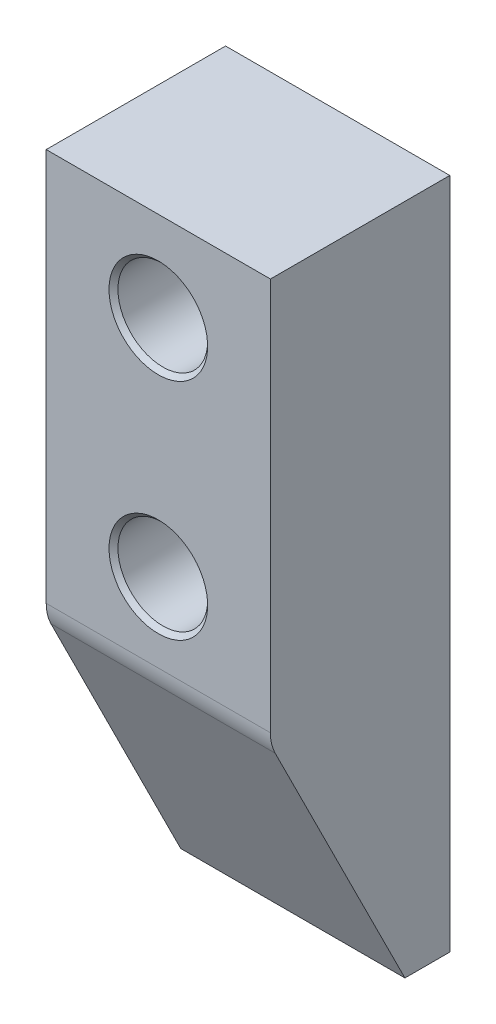
ISO-10303-21;
HEADER;
FILE_DESCRIPTION(('STEP AP214'),'2;1');
FILE_NAME('part.step','',(''),(''),'','','');
FILE_SCHEMA(('AUTOMOTIVE_DESIGN { 1 0 10303 214 1 1 1 1 }'));
ENDSEC;
DATA;
#1=APPLICATION_CONTEXT('core data for automotive mechanical design processes');
#2=APPLICATION_PROTOCOL_DEFINITION('international standard','automotive_design',2000,#1);
#3=PRODUCT_CONTEXT('',#1,'mechanical');
#4=PRODUCT('Part','Part','',(#3));
#5=PRODUCT_RELATED_PRODUCT_CATEGORY('part','',(#4));
#6=PRODUCT_DEFINITION_FORMATION('','',#4);
#7=PRODUCT_DEFINITION_CONTEXT('part definition',#1,'design');
#8=PRODUCT_DEFINITION('design','',#6,#7);
#9=PRODUCT_DEFINITION_SHAPE('','',#8);
#10=(LENGTH_UNIT() NAMED_UNIT(*) SI_UNIT(.MILLI.,.METRE.));
#11=(NAMED_UNIT(*) PLANE_ANGLE_UNIT() SI_UNIT($,.RADIAN.));
#12=(NAMED_UNIT(*) SI_UNIT($,.STERADIAN.) SOLID_ANGLE_UNIT());
#13=UNCERTAINTY_MEASURE_WITH_UNIT(LENGTH_MEASURE(1.E-05),#10,'distance_accuracy_value','');
#14=(GEOMETRIC_REPRESENTATION_CONTEXT(3) GLOBAL_UNCERTAINTY_ASSIGNED_CONTEXT((#13)) GLOBAL_UNIT_ASSIGNED_CONTEXT((#10,
#11,#12)) REPRESENTATION_CONTEXT('',''));
#15=CARTESIAN_POINT('',(0.,0.,0.));
#16=DIRECTION('',(0.,0.,1.));
#17=DIRECTION('',(1.,0.,0.));
#18=AXIS2_PLACEMENT_3D('',#15,#16,#17);
#19=CARTESIAN_POINT('',(0.,0.,40.));
#20=DIRECTION('',(1.,0.,0.));
#21=DIRECTION('',(0.,0.,-1.));
#22=AXIS2_PLACEMENT_3D('',#19,#20,#21);
#23=PLANE('',#22);
#24=DIRECTION('',(0.,-0.894427190999917,-0.447213595499956));
#25=VECTOR('',#24,1.);
#26=CARTESIAN_POINT('',(0.,60.0000000000004,40.));
#27=LINE('',#26,#25);
#28=CARTESIAN_POINT('',(0.,0.,9.99999999999995));
#29=VERTEX_POINT('',#28);
#30=CARTESIAN_POINT('',(0.,57.8885438199988,38.9442719099992));
#31=VERTEX_POINT('',#30);
#32=EDGE_CURVE('E132',#29,#31,#27,.F.);
#33=ORIENTED_EDGE('',*,*,#32,.T.);
#34=CARTESIAN_POINT('',(0.,62.3606797749983,30.));
#35=DIRECTION('',(1.,0.,0.));
#36=DIRECTION('',(0.,0.,-1.));
#37=AXIS2_PLACEMENT_3D('',#34,#35,#36);
#38=CIRCLE('',#37,10.);
#39=CARTESIAN_POINT('',(0.,62.3606797749983,40.));
#40=VERTEX_POINT('',#39);
#41=EDGE_CURVE('E137',#31,#40,#38,.F.);
#42=ORIENTED_EDGE('',*,*,#41,.T.);
#43=DIRECTION('',(0.,-1.,0.));
#44=VECTOR('',#43,1.);
#45=CARTESIAN_POINT('',(0.,0.,40.));
#46=LINE('',#45,#44);
#47=CARTESIAN_POINT('',(0.,150.,40.));
#48=VERTEX_POINT('',#47);
#49=EDGE_CURVE('E96',#48,#40,#46,.T.);
#50=ORIENTED_EDGE('',*,*,#49,.F.);
#51=DIRECTION('',(0.,0.,-1.));
#52=VECTOR('',#51,1.);
#53=CARTESIAN_POINT('',(0.,150.,40.));
#54=LINE('',#53,#52);
#55=CARTESIAN_POINT('',(0.,150.,0.));
#56=VERTEX_POINT('',#55);
#57=EDGE_CURVE('E106',#48,#56,#54,.T.);
#58=ORIENTED_EDGE('',*,*,#57,.T.);
#59=DIRECTION('',(0.,-1.,0.));
#60=VECTOR('',#59,1.);
#61=CARTESIAN_POINT('',(0.,0.,0.));
#62=LINE('',#61,#60);
#63=CARTESIAN_POINT('',(0.,0.,0.));
#64=VERTEX_POINT('',#63);
#65=EDGE_CURVE('E115',#56,#64,#62,.T.);
#66=ORIENTED_EDGE('',*,*,#65,.T.);
#67=DIRECTION('',(0.,0.,-1.));
#68=VECTOR('',#67,1.);
#69=CARTESIAN_POINT('',(0.,0.,40.));
#70=LINE('',#69,#68);
#71=EDGE_CURVE('E126',#29,#64,#70,.T.);
#72=ORIENTED_EDGE('',*,*,#71,.F.);
#73=EDGE_LOOP('',(#33,#42,#50,#58,#66,#72));
#74=FACE_BOUND('',#73,.T.);
#75=ADVANCED_FACE('F34',(#74),#23,.F.);
#76=CARTESIAN_POINT('',(0.,0.,40.));
#77=DIRECTION('',(0.,1.,0.));
#78=DIRECTION('',(0.,0.,1.));
#79=AXIS2_PLACEMENT_3D('',#76,#77,#78);
#80=PLANE('',#79);
#81=DIRECTION('',(0.,0.,-1.));
#82=VECTOR('',#81,1.);
#83=CARTESIAN_POINT('',(50.,0.,40.));
#84=LINE('',#83,#82);
#85=CARTESIAN_POINT('',(50.,0.,9.99999999999995));
#86=VERTEX_POINT('',#85);
#87=CARTESIAN_POINT('',(50.,0.,0.));
#88=VERTEX_POINT('',#87);
#89=EDGE_CURVE('E105',#86,#88,#84,.T.);
#90=ORIENTED_EDGE('',*,*,#89,.F.);
#91=DIRECTION('',(-1.,0.,0.));
#92=VECTOR('',#91,1.);
#93=CARTESIAN_POINT('',(0.,0.,9.99999999999995));
#94=LINE('',#93,#92);
#95=EDGE_CURVE('E130',#86,#29,#94,.T.);
#96=ORIENTED_EDGE('',*,*,#95,.T.);
#97=ORIENTED_EDGE('',*,*,#71,.T.);
#98=DIRECTION('',(1.,0.,0.));
#99=VECTOR('',#98,1.);
#100=CARTESIAN_POINT('',(0.,0.,0.));
#101=LINE('',#100,#99);
#102=EDGE_CURVE('E118',#64,#88,#101,.T.);
#103=ORIENTED_EDGE('',*,*,#102,.T.);
#104=EDGE_LOOP('',(#90,#96,#97,#103));
#105=FACE_BOUND('',#104,.T.);
#106=ADVANCED_FACE('F181',(#105),#80,.F.);
#107=CARTESIAN_POINT('',(50.,0.,40.));
#108=DIRECTION('',(-1.,0.,0.));
#109=DIRECTION('',(0.,0.,1.));
#110=AXIS2_PLACEMENT_3D('',#107,#108,#109);
#111=PLANE('',#110);
#112=DIRECTION('',(0.,1.,0.));
#113=VECTOR('',#112,1.);
#114=CARTESIAN_POINT('',(50.,0.,40.));
#115=LINE('',#114,#113);
#116=CARTESIAN_POINT('',(50.,62.3606797749983,40.));
#117=VERTEX_POINT('',#116);
#118=CARTESIAN_POINT('',(50.,150.,40.));
#119=VERTEX_POINT('',#118);
#120=EDGE_CURVE('E87',#117,#119,#115,.T.);
#121=ORIENTED_EDGE('',*,*,#120,.F.);
#122=CARTESIAN_POINT('',(50.,62.3606797749983,30.));
#123=DIRECTION('',(-1.,0.,0.));
#124=DIRECTION('',(0.,0.,1.));
#125=AXIS2_PLACEMENT_3D('',#122,#123,#124);
#126=CIRCLE('',#125,10.);
#127=CARTESIAN_POINT('',(50.,57.8885438199988,38.9442719099992));
#128=VERTEX_POINT('',#127);
#129=EDGE_CURVE('E57',#117,#128,#126,.F.);
#130=ORIENTED_EDGE('',*,*,#129,.T.);
#131=DIRECTION('',(0.,0.894427190999917,0.447213595499956));
#132=VECTOR('',#131,1.);
#133=CARTESIAN_POINT('',(50.,60.0000000000004,40.));
#134=LINE('',#133,#132);
#135=EDGE_CURVE('E128',#128,#86,#134,.F.);
#136=ORIENTED_EDGE('',*,*,#135,.T.);
#137=ORIENTED_EDGE('',*,*,#89,.T.);
#138=DIRECTION('',(0.,1.,0.));
#139=VECTOR('',#138,1.);
#140=CARTESIAN_POINT('',(50.,0.,0.));
#141=LINE('',#140,#139);
#142=CARTESIAN_POINT('',(50.,150.,0.));
#143=VERTEX_POINT('',#142);
#144=EDGE_CURVE('E102',#88,#143,#141,.T.);
#145=ORIENTED_EDGE('',*,*,#144,.T.);
#146=DIRECTION('',(0.,0.,-1.));
#147=VECTOR('',#146,1.);
#148=CARTESIAN_POINT('',(50.,150.,40.));
#149=LINE('',#148,#147);
#150=EDGE_CURVE('E99',#119,#143,#149,.T.);
#151=ORIENTED_EDGE('',*,*,#150,.F.);
#152=EDGE_LOOP('',(#121,#130,#136,#137,#145,#151));
#153=FACE_BOUND('',#152,.T.);
#154=ADVANCED_FACE('F100',(#153),#111,.F.);
#155=CARTESIAN_POINT('',(0.,150.,40.));
#156=DIRECTION('',(0.,-1.,0.));
#157=DIRECTION('',(0.,0.,-1.));
#158=AXIS2_PLACEMENT_3D('',#155,#156,#157);
#159=PLANE('',#158);
#160=DIRECTION('',(-1.,0.,0.));
#161=VECTOR('',#160,1.);
#162=CARTESIAN_POINT('',(0.,150.,0.));
#163=LINE('',#162,#161);
#164=EDGE_CURVE('E123',#143,#56,#163,.T.);
#165=ORIENTED_EDGE('',*,*,#164,.T.);
#166=ORIENTED_EDGE('',*,*,#57,.F.);
#167=DIRECTION('',(-1.,0.,0.));
#168=VECTOR('',#167,1.);
#169=CARTESIAN_POINT('',(0.,150.,40.));
#170=LINE('',#169,#168);
#171=EDGE_CURVE('E92',#119,#48,#170,.T.);
#172=ORIENTED_EDGE('',*,*,#171,.F.);
#173=ORIENTED_EDGE('',*,*,#150,.T.);
#174=EDGE_LOOP('',(#165,#166,#172,#173));
#175=FACE_BOUND('',#174,.T.);
#176=ADVANCED_FACE('F108',(#175),#159,.F.);
#177=CARTESIAN_POINT('',(0.,0.,40.));
#178=DIRECTION('',(0.,0.,-1.));
#179=DIRECTION('',(-1.,0.,0.));
#180=AXIS2_PLACEMENT_3D('',#177,#178,#179);
#181=PLANE('',#180);
#182=CARTESIAN_POINT('',(25.,80.,40.));
#183=DIRECTION('',(0.,0.,-1.));
#184=DIRECTION('',(-1.,0.,0.));
#185=AXIS2_PLACEMENT_3D('',#182,#183,#184);
#186=CIRCLE('',#185,11.);
#187=CARTESIAN_POINT('',(14.,80.,40.));
#188=VERTEX_POINT('',#187);
#189=EDGE_CURVE('E42',#188,#188,#186,.T.);
#190=ORIENTED_EDGE('',*,*,#189,.T.);
#191=EDGE_LOOP('',(#190));
#192=FACE_BOUND('',#191,.T.);
#193=CARTESIAN_POINT('',(25.,130.,40.));
#194=DIRECTION('',(0.,0.,-1.));
#195=DIRECTION('',(-1.,0.,0.));
#196=AXIS2_PLACEMENT_3D('',#193,#194,#195);
#197=CIRCLE('',#196,11.0000000000001);
#198=CARTESIAN_POINT('',(13.9999999999999,130.,40.));
#199=VERTEX_POINT('',#198);
#200=EDGE_CURVE('E142',#199,#199,#197,.T.);
#201=ORIENTED_EDGE('',*,*,#200,.T.);
#202=EDGE_LOOP('',(#201));
#203=FACE_BOUND('',#202,.T.);
#204=ORIENTED_EDGE('',*,*,#49,.T.);
#205=DIRECTION('',(-1.,0.,0.));
#206=VECTOR('',#205,1.);
#207=CARTESIAN_POINT('',(50.,62.3606797749983,40.));
#208=LINE('',#207,#206);
#209=EDGE_CURVE('E95',#40,#117,#208,.F.);
#210=ORIENTED_EDGE('',*,*,#209,.T.);
#211=ORIENTED_EDGE('',*,*,#120,.T.);
#212=ORIENTED_EDGE('',*,*,#171,.T.);
#213=EDGE_LOOP('',(#204,#210,#211,#212));
#214=FACE_BOUND('',#213,.T.);
#215=ADVANCED_FACE('F90',(#192,#203,#214),#181,.F.);
#216=CARTESIAN_POINT('',(0.,0.,0.));
#217=DIRECTION('',(0.,0.,-1.));
#218=DIRECTION('',(-1.,0.,0.));
#219=AXIS2_PLACEMENT_3D('',#216,#217,#218);
#220=PLANE('',#219);
#221=CARTESIAN_POINT('',(25.,130.,0.));
#222=DIRECTION('',(0.,0.,1.));
#223=DIRECTION('',(1.,0.,0.));
#224=AXIS2_PLACEMENT_3D('',#221,#222,#223);
#225=CIRCLE('',#224,5.);
#226=CARTESIAN_POINT('',(30.,130.,0.));
#227=VERTEX_POINT('',#226);
#228=EDGE_CURVE('E165',#227,#227,#225,.T.);
#229=ORIENTED_EDGE('',*,*,#228,.T.);
#230=EDGE_LOOP('',(#229));
#231=FACE_BOUND('',#230,.T.);
#232=CARTESIAN_POINT('',(25.,80.,0.));
#233=DIRECTION('',(0.,0.,1.));
#234=DIRECTION('',(1.,0.,0.));
#235=AXIS2_PLACEMENT_3D('',#232,#233,#234);
#236=CIRCLE('',#235,5.);
#237=CARTESIAN_POINT('',(30.,80.,0.));
#238=VERTEX_POINT('',#237);
#239=EDGE_CURVE('E324',#238,#238,#236,.T.);
#240=ORIENTED_EDGE('',*,*,#239,.T.);
#241=EDGE_LOOP('',(#240));
#242=FACE_BOUND('',#241,.T.);
#243=ORIENTED_EDGE('',*,*,#65,.F.);
#244=ORIENTED_EDGE('',*,*,#164,.F.);
#245=ORIENTED_EDGE('',*,*,#144,.F.);
#246=ORIENTED_EDGE('',*,*,#102,.F.);
#247=EDGE_LOOP('',(#243,#244,#245,#246));
#248=FACE_BOUND('',#247,.T.);
#249=ADVANCED_FACE('F185',(#231,#242,#248),#220,.T.);
#250=CARTESIAN_POINT('',(0.,60.0000000000004,40.));
#251=DIRECTION('',(0.,0.447213595499956,-0.894427190999917));
#252=DIRECTION('',(1.,0.,0.));
#253=AXIS2_PLACEMENT_3D('',#250,#251,#252);
#254=PLANE('',#253);
#255=ORIENTED_EDGE('',*,*,#135,.F.);
#256=DIRECTION('',(1.,0.,0.));
#257=VECTOR('',#256,1.);
#258=CARTESIAN_POINT('',(0.,57.8885438199988,38.9442719099992));
#259=LINE('',#258,#257);
#260=EDGE_CURVE('E49',#128,#31,#259,.F.);
#261=ORIENTED_EDGE('',*,*,#260,.T.);
#262=ORIENTED_EDGE('',*,*,#32,.F.);
#263=ORIENTED_EDGE('',*,*,#95,.F.);
#264=EDGE_LOOP('',(#255,#261,#262,#263));
#265=FACE_BOUND('',#264,.T.);
#266=ADVANCED_FACE('F178',(#265),#254,.F.);
#267=CARTESIAN_POINT('',(0.,62.3606797749983,30.));
#268=DIRECTION('',(1.,0.,0.));
#269=DIRECTION('',(0.,0.,-1.));
#270=AXIS2_PLACEMENT_3D('',#267,#268,#269);
#271=CYLINDRICAL_SURFACE('',#270,10.);
#272=ORIENTED_EDGE('',*,*,#41,.F.);
#273=ORIENTED_EDGE('',*,*,#260,.F.);
#274=ORIENTED_EDGE('',*,*,#129,.F.);
#275=ORIENTED_EDGE('',*,*,#209,.F.);
#276=EDGE_LOOP('',(#272,#273,#274,#275));
#277=FACE_BOUND('',#276,.T.);
#278=ADVANCED_FACE('F159',(#277),#271,.T.);
#279=CARTESIAN_POINT('',(25.,80.,25.));
#280=DIRECTION('',(0.,0.,1.));
#281=DIRECTION('',(1.,0.,0.));
#282=AXIS2_PLACEMENT_3D('',#279,#280,#281);
#283=CYLINDRICAL_SURFACE('',#282,9.99999999999999);
#284=CARTESIAN_POINT('',(25.,80.,39.));
#285=DIRECTION('',(0.,0.,-1.));
#286=DIRECTION('',(-1.,0.,0.));
#287=AXIS2_PLACEMENT_3D('',#284,#285,#286);
#288=CIRCLE('',#287,9.99999999999999);
#289=CARTESIAN_POINT('',(15.,80.,39.));
#290=VERTEX_POINT('',#289);
#291=EDGE_CURVE('E139',#290,#290,#288,.F.);
#292=ORIENTED_EDGE('',*,*,#291,.T.);
#293=EDGE_LOOP('',(#292));
#294=FACE_BOUND('',#293,.T.);
#295=CARTESIAN_POINT('',(25.,80.,25.));
#296=DIRECTION('',(0.,0.,1.));
#297=DIRECTION('',(1.,0.,0.));
#298=AXIS2_PLACEMENT_3D('',#295,#296,#297);
#299=CIRCLE('',#298,9.99999999999999);
#300=CARTESIAN_POINT('',(35.,80.,25.));
#301=VERTEX_POINT('',#300);
#302=EDGE_CURVE('E163',#301,#301,#299,.T.);
#303=ORIENTED_EDGE('',*,*,#302,.F.);
#304=EDGE_LOOP('',(#303));
#305=FACE_BOUND('',#304,.T.);
#306=ADVANCED_FACE('F155',(#294,#305),#283,.F.);
#307=CARTESIAN_POINT('',(25.,80.,25.));
#308=DIRECTION('',(0.,0.,1.));
#309=DIRECTION('',(1.,0.,0.));
#310=AXIS2_PLACEMENT_3D('',#307,#308,#309);
#311=PLANE('',#310);
#312=CARTESIAN_POINT('',(25.,80.,25.));
#313=DIRECTION('',(0.,0.,1.));
#314=DIRECTION('',(1.,0.,0.));
#315=AXIS2_PLACEMENT_3D('',#312,#313,#314);
#316=CIRCLE('',#315,5.);
#317=CARTESIAN_POINT('',(30.,80.,25.));
#318=VERTEX_POINT('',#317);
#319=EDGE_CURVE('E327',#318,#318,#316,.T.);
#320=ORIENTED_EDGE('',*,*,#319,.F.);
#321=EDGE_LOOP('',(#320));
#322=FACE_BOUND('',#321,.T.);
#323=ORIENTED_EDGE('',*,*,#302,.T.);
#324=EDGE_LOOP('',(#323));
#325=FACE_BOUND('',#324,.T.);
#326=ADVANCED_FACE('F158',(#322,#325),#311,.T.);
#327=CARTESIAN_POINT('',(25.,130.,25.));
#328=DIRECTION('',(0.,0.,1.));
#329=DIRECTION('',(1.,0.,0.));
#330=AXIS2_PLACEMENT_3D('',#327,#328,#329);
#331=CYLINDRICAL_SURFACE('',#330,10.);
#332=CARTESIAN_POINT('',(25.,130.,38.9999999999999));
#333=DIRECTION('',(0.,0.,-1.));
#334=DIRECTION('',(-1.,0.,0.));
#335=AXIS2_PLACEMENT_3D('',#332,#333,#334);
#336=CIRCLE('',#335,10.);
#337=CARTESIAN_POINT('',(15.,130.,38.9999999999999));
#338=VERTEX_POINT('',#337);
#339=EDGE_CURVE('E11',#338,#338,#336,.F.);
#340=ORIENTED_EDGE('',*,*,#339,.T.);
#341=EDGE_LOOP('',(#340));
#342=FACE_BOUND('',#341,.T.);
#343=CARTESIAN_POINT('',(25.,130.,25.));
#344=DIRECTION('',(0.,0.,1.));
#345=DIRECTION('',(1.,0.,0.));
#346=AXIS2_PLACEMENT_3D('',#343,#344,#345);
#347=CIRCLE('',#346,10.);
#348=CARTESIAN_POINT('',(35.,130.,25.));
#349=VERTEX_POINT('',#348);
#350=EDGE_CURVE('E119',#349,#349,#347,.T.);
#351=ORIENTED_EDGE('',*,*,#350,.F.);
#352=EDGE_LOOP('',(#351));
#353=FACE_BOUND('',#352,.T.);
#354=ADVANCED_FACE('F222',(#342,#353),#331,.F.);
#355=CARTESIAN_POINT('',(25.,130.,25.));
#356=DIRECTION('',(0.,0.,1.));
#357=DIRECTION('',(1.,0.,0.));
#358=AXIS2_PLACEMENT_3D('',#355,#356,#357);
#359=PLANE('',#358);
#360=CARTESIAN_POINT('',(25.,130.,25.));
#361=DIRECTION('',(0.,0.,1.));
#362=DIRECTION('',(1.,0.,0.));
#363=AXIS2_PLACEMENT_3D('',#360,#361,#362);
#364=CIRCLE('',#363,5.);
#365=CARTESIAN_POINT('',(30.,130.,25.));
#366=VERTEX_POINT('',#365);
#367=EDGE_CURVE('E170',#366,#366,#364,.T.);
#368=ORIENTED_EDGE('',*,*,#367,.F.);
#369=EDGE_LOOP('',(#368));
#370=FACE_BOUND('',#369,.T.);
#371=ORIENTED_EDGE('',*,*,#350,.T.);
#372=EDGE_LOOP('',(#371));
#373=FACE_BOUND('',#372,.T.);
#374=ADVANCED_FACE('F152',(#370,#373),#359,.T.);
#375=CARTESIAN_POINT('',(25.,80.,39.));
#376=DIRECTION('',(0.,0.,1.));
#377=DIRECTION('',(1.,0.,0.));
#378=AXIS2_PLACEMENT_3D('',#375,#376,#377);
#379=CONICAL_SURFACE('',#378,9.99999999999999,0.785398163397453);
#380=ORIENTED_EDGE('',*,*,#189,.F.);
#381=EDGE_LOOP('',(#380));
#382=FACE_BOUND('',#381,.T.);
#383=ORIENTED_EDGE('',*,*,#291,.F.);
#384=EDGE_LOOP('',(#383));
#385=FACE_BOUND('',#384,.T.);
#386=ADVANCED_FACE('F149',(#382,#385),#379,.F.);
#387=CARTESIAN_POINT('',(25.,130.,38.9999999999999));
#388=DIRECTION('',(0.,0.,1.));
#389=DIRECTION('',(1.,0.,0.));
#390=AXIS2_PLACEMENT_3D('',#387,#388,#389);
#391=CONICAL_SURFACE('',#390,10.,0.785398163397444);
#392=ORIENTED_EDGE('',*,*,#200,.F.);
#393=EDGE_LOOP('',(#392));
#394=FACE_BOUND('',#393,.T.);
#395=ORIENTED_EDGE('',*,*,#339,.F.);
#396=EDGE_LOOP('',(#395));
#397=FACE_BOUND('',#396,.T.);
#398=ADVANCED_FACE('F36',(#394,#397),#391,.F.);
#399=CARTESIAN_POINT('',(25.,80.,0.));
#400=DIRECTION('',(0.,0.,1.));
#401=DIRECTION('',(1.,0.,0.));
#402=AXIS2_PLACEMENT_3D('',#399,#400,#401);
#403=CYLINDRICAL_SURFACE('',#402,5.);
#404=ORIENTED_EDGE('',*,*,#239,.F.);
#405=EDGE_LOOP('',(#404));
#406=FACE_BOUND('',#405,.T.);
#407=ORIENTED_EDGE('',*,*,#319,.T.);
#408=EDGE_LOOP('',(#407));
#409=FACE_BOUND('',#408,.T.);
#410=ADVANCED_FACE('F248',(#406,#409),#403,.F.);
#411=CARTESIAN_POINT('',(25.,130.,0.));
#412=DIRECTION('',(0.,0.,1.));
#413=DIRECTION('',(1.,0.,0.));
#414=AXIS2_PLACEMENT_3D('',#411,#412,#413);
#415=CYLINDRICAL_SURFACE('',#414,5.);
#416=ORIENTED_EDGE('',*,*,#228,.F.);
#417=EDGE_LOOP('',(#416));
#418=FACE_BOUND('',#417,.T.);
#419=ORIENTED_EDGE('',*,*,#367,.T.);
#420=EDGE_LOOP('',(#419));
#421=FACE_BOUND('',#420,.T.);
#422=ADVANCED_FACE('F254',(#418,#421),#415,.F.);
#423=CLOSED_SHELL('',(#75,#106,#154,#176,#215,#249,#266,#278,#306,#326,#354,#374,#386,#398,#410,#422));
#424=MANIFOLD_SOLID_BREP('B2',#423);
#425=ADVANCED_BREP_SHAPE_REPRESENTATION('',(#18,#424),#14);
#426=SHAPE_DEFINITION_REPRESENTATION(#9,#425);
ENDSEC;
END-ISO-10303-21;
